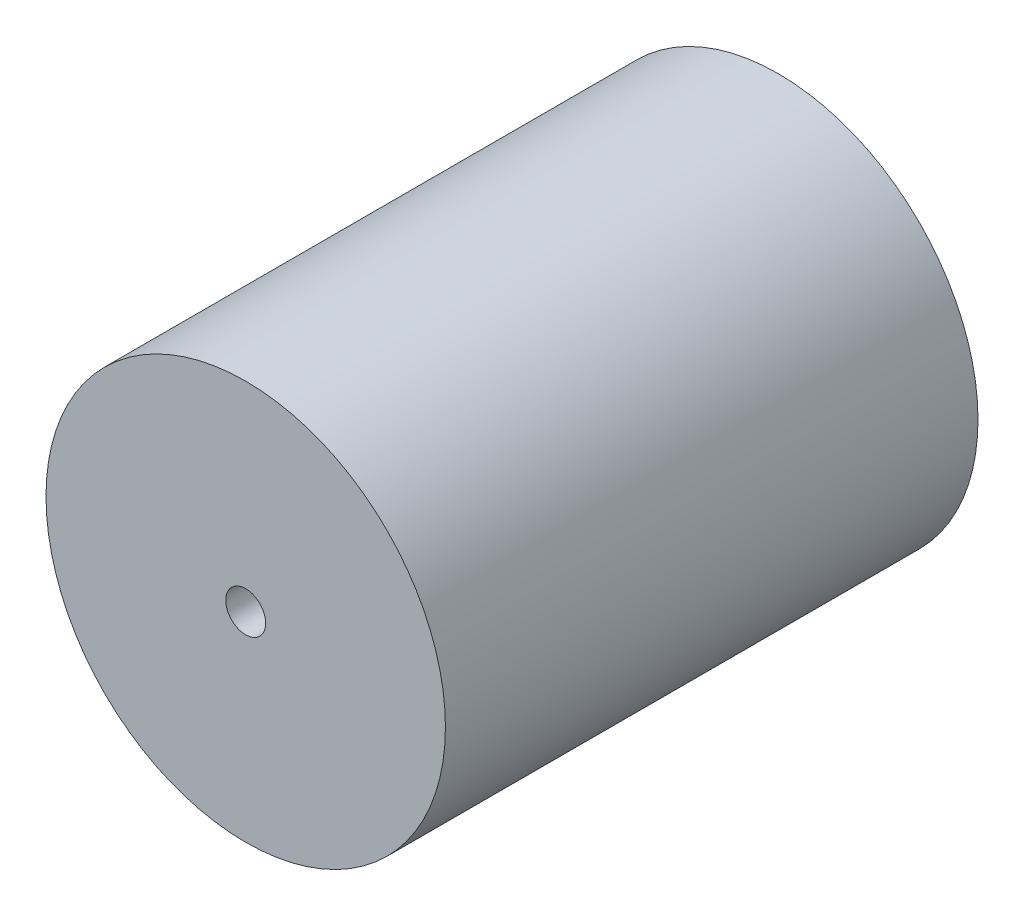
ISO-10303-21;
HEADER;
FILE_DESCRIPTION(('STEP AP214'),'2;1');
FILE_NAME('part.step','',(''),(''),'','','');
FILE_SCHEMA(('AUTOMOTIVE_DESIGN { 1 0 10303 214 1 1 1 1 }'));
ENDSEC;
DATA;
#1=APPLICATION_CONTEXT('core data for automotive mechanical design processes');
#2=APPLICATION_PROTOCOL_DEFINITION('international standard','automotive_design',2000,#1);
#3=PRODUCT_CONTEXT('',#1,'mechanical');
#4=PRODUCT('Part','Part','',(#3));
#5=PRODUCT_RELATED_PRODUCT_CATEGORY('part','',(#4));
#6=PRODUCT_DEFINITION_FORMATION('','',#4);
#7=PRODUCT_DEFINITION_CONTEXT('part definition',#1,'design');
#8=PRODUCT_DEFINITION('design','',#6,#7);
#9=PRODUCT_DEFINITION_SHAPE('','',#8);
#10=(LENGTH_UNIT() NAMED_UNIT(*) SI_UNIT(.MILLI.,.METRE.));
#11=(NAMED_UNIT(*) PLANE_ANGLE_UNIT() SI_UNIT($,.RADIAN.));
#12=(NAMED_UNIT(*) SI_UNIT($,.STERADIAN.) SOLID_ANGLE_UNIT());
#13=UNCERTAINTY_MEASURE_WITH_UNIT(LENGTH_MEASURE(1.E-05),#10,'distance_accuracy_value','');
#14=(GEOMETRIC_REPRESENTATION_CONTEXT(3) GLOBAL_UNCERTAINTY_ASSIGNED_CONTEXT((#13)) GLOBAL_UNIT_ASSIGNED_CONTEXT((#10,
#11,#12)) REPRESENTATION_CONTEXT('',''));
#15=CARTESIAN_POINT('',(0.,0.,0.));
#16=DIRECTION('',(0.,0.,1.));
#17=DIRECTION('',(1.,0.,0.));
#18=AXIS2_PLACEMENT_3D('',#15,#16,#17);
#19=CARTESIAN_POINT('',(0.,0.,40.));
#20=DIRECTION('',(0.,0.,1.));
#21=DIRECTION('',(1.,0.,0.));
#22=AXIS2_PLACEMENT_3D('',#19,#20,#21);
#23=PLANE('',#22);
#24=CARTESIAN_POINT('',(0.,0.,40.));
#25=DIRECTION('',(0.,0.,1.));
#26=DIRECTION('',(1.,0.,0.));
#27=AXIS2_PLACEMENT_3D('',#24,#25,#26);
#28=CIRCLE('',#27,15.);
#29=CARTESIAN_POINT('',(15.,0.,40.));
#30=VERTEX_POINT('',#29);
#31=EDGE_CURVE('E10',#30,#30,#28,.T.);
#32=ORIENTED_EDGE('',*,*,#31,.T.);
#33=EDGE_LOOP('',(#32));
#34=FACE_BOUND('',#33,.T.);
#35=CARTESIAN_POINT('',(0.,0.,40.));
#36=DIRECTION('',(0.,0.,1.));
#37=DIRECTION('',(1.,0.,0.));
#38=AXIS2_PLACEMENT_3D('',#35,#36,#37);
#39=CIRCLE('',#38,1.5);
#40=CARTESIAN_POINT('',(1.5,0.,40.));
#41=VERTEX_POINT('',#40);
#42=EDGE_CURVE('E50',#41,#41,#39,.T.);
#43=ORIENTED_EDGE('',*,*,#42,.F.);
#44=EDGE_LOOP('',(#43));
#45=FACE_BOUND('',#44,.T.);
#46=ADVANCED_FACE('F37',(#34,#45),#23,.T.);
#47=CARTESIAN_POINT('',(0.,0.,0.));
#48=DIRECTION('',(0.,0.,1.));
#49=DIRECTION('',(1.,0.,0.));
#50=AXIS2_PLACEMENT_3D('',#47,#48,#49);
#51=PLANE('',#50);
#52=CARTESIAN_POINT('',(0.,0.,0.));
#53=DIRECTION('',(0.,0.,1.));
#54=DIRECTION('',(1.,0.,0.));
#55=AXIS2_PLACEMENT_3D('',#52,#53,#54);
#56=CIRCLE('',#55,15.);
#57=CARTESIAN_POINT('',(15.,0.,0.));
#58=VERTEX_POINT('',#57);
#59=EDGE_CURVE('E41',#58,#58,#56,.T.);
#60=ORIENTED_EDGE('',*,*,#59,.F.);
#61=EDGE_LOOP('',(#60));
#62=FACE_BOUND('',#61,.T.);
#63=CARTESIAN_POINT('',(0.,0.,0.));
#64=DIRECTION('',(0.,0.,1.));
#65=DIRECTION('',(1.,0.,0.));
#66=AXIS2_PLACEMENT_3D('',#63,#64,#65);
#67=CIRCLE('',#66,1.5);
#68=CARTESIAN_POINT('',(1.5,0.,0.));
#69=VERTEX_POINT('',#68);
#70=EDGE_CURVE('E52',#69,#69,#67,.T.);
#71=ORIENTED_EDGE('',*,*,#70,.T.);
#72=EDGE_LOOP('',(#71));
#73=FACE_BOUND('',#72,.T.);
#74=ADVANCED_FACE('F64',(#62,#73),#51,.F.);
#75=CARTESIAN_POINT('',(0.,0.,40.));
#76=DIRECTION('',(0.,0.,-1.));
#77=DIRECTION('',(-1.,0.,0.));
#78=AXIS2_PLACEMENT_3D('',#75,#76,#77);
#79=CYLINDRICAL_SURFACE('',#78,15.);
#80=ORIENTED_EDGE('',*,*,#31,.F.);
#81=EDGE_LOOP('',(#80));
#82=FACE_BOUND('',#81,.T.);
#83=ORIENTED_EDGE('',*,*,#59,.T.);
#84=EDGE_LOOP('',(#83));
#85=FACE_BOUND('',#84,.T.);
#86=ADVANCED_FACE('F39',(#82,#85),#79,.T.);
#87=CARTESIAN_POINT('',(0.,0.,40.));
#88=DIRECTION('',(0.,0.,-1.));
#89=DIRECTION('',(-1.,0.,0.));
#90=AXIS2_PLACEMENT_3D('',#87,#88,#89);
#91=CYLINDRICAL_SURFACE('',#90,1.5);
#92=ORIENTED_EDGE('',*,*,#42,.T.);
#93=EDGE_LOOP('',(#92));
#94=FACE_BOUND('',#93,.T.);
#95=ORIENTED_EDGE('',*,*,#70,.F.);
#96=EDGE_LOOP('',(#95));
#97=FACE_BOUND('',#96,.T.);
#98=ADVANCED_FACE('F60',(#94,#97),#91,.F.);
#99=CLOSED_SHELL('',(#46,#74,#86,#98));
#100=MANIFOLD_SOLID_BREP('B2',#99);
#101=ADVANCED_BREP_SHAPE_REPRESENTATION('',(#18,#100),#14);
#102=SHAPE_DEFINITION_REPRESENTATION(#9,#101);
ENDSEC;
END-ISO-10303-21;
